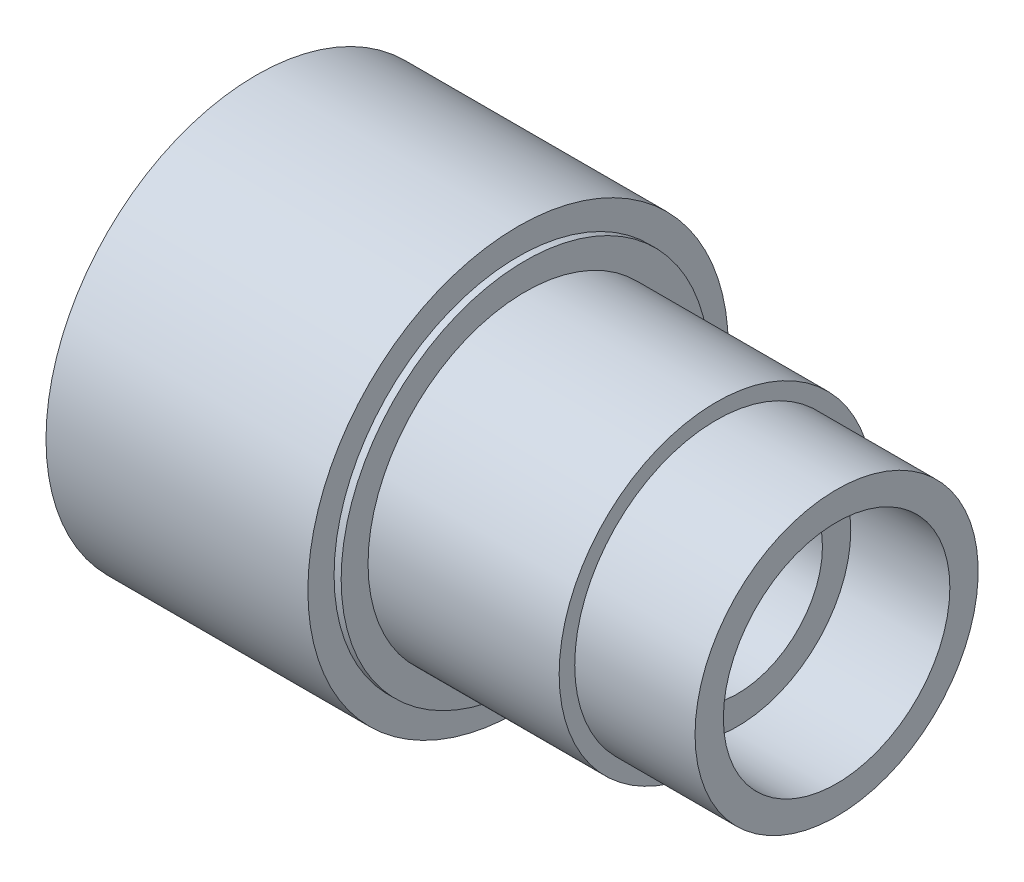
ISO-10303-21;
HEADER;
FILE_DESCRIPTION(('STEP AP214'),'2;1');
FILE_NAME('part.step','',(''),(''),'','','');
FILE_SCHEMA(('AUTOMOTIVE_DESIGN { 1 0 10303 214 1 1 1 1 }'));
ENDSEC;
DATA;
#1=APPLICATION_CONTEXT('core data for automotive mechanical design processes');
#2=APPLICATION_PROTOCOL_DEFINITION('international standard','automotive_design',2000,#1);
#3=PRODUCT_CONTEXT('',#1,'mechanical');
#4=PRODUCT('Part','Part','',(#3));
#5=PRODUCT_RELATED_PRODUCT_CATEGORY('part','',(#4));
#6=PRODUCT_DEFINITION_FORMATION('','',#4);
#7=PRODUCT_DEFINITION_CONTEXT('part definition',#1,'design');
#8=PRODUCT_DEFINITION('design','',#6,#7);
#9=PRODUCT_DEFINITION_SHAPE('','',#8);
#10=(LENGTH_UNIT() NAMED_UNIT(*) SI_UNIT(.MILLI.,.METRE.));
#11=(NAMED_UNIT(*) PLANE_ANGLE_UNIT() SI_UNIT($,.RADIAN.));
#12=(NAMED_UNIT(*) SI_UNIT($,.STERADIAN.) SOLID_ANGLE_UNIT());
#13=UNCERTAINTY_MEASURE_WITH_UNIT(LENGTH_MEASURE(1.E-05),#10,'distance_accuracy_value','');
#14=(GEOMETRIC_REPRESENTATION_CONTEXT(3) GLOBAL_UNCERTAINTY_ASSIGNED_CONTEXT((#13)) GLOBAL_UNIT_ASSIGNED_CONTEXT((#10,
#11,#12)) REPRESENTATION_CONTEXT('',''));
#15=CARTESIAN_POINT('',(0.,0.,0.));
#16=DIRECTION('',(0.,0.,1.));
#17=DIRECTION('',(1.,0.,0.));
#18=AXIS2_PLACEMENT_3D('',#15,#16,#17);
#19=CARTESIAN_POINT('',(15.,8.,0.));
#20=DIRECTION('',(-1.,0.,0.));
#21=DIRECTION('',(0.,0.,1.));
#22=AXIS2_PLACEMENT_3D('',#19,#20,#21);
#23=PLANE('',#22);
#24=CARTESIAN_POINT('',(15.,0.,0.));
#25=DIRECTION('',(1.,0.,0.));
#26=DIRECTION('',(0.,0.,-1.));
#27=AXIS2_PLACEMENT_3D('',#24,#25,#26);
#28=CIRCLE('',#27,6.);
#29=CARTESIAN_POINT('',(15.,0.,-6.));
#30=VERTEX_POINT('',#29);
#31=EDGE_CURVE('E80',#30,#30,#28,.T.);
#32=ORIENTED_EDGE('',*,*,#31,.F.);
#33=EDGE_LOOP('',(#32));
#34=FACE_BOUND('',#33,.T.);
#35=CARTESIAN_POINT('',(15.,0.,0.));
#36=DIRECTION('',(-1.,0.,0.));
#37=DIRECTION('',(0.,0.,1.));
#38=AXIS2_PLACEMENT_3D('',#35,#36,#37);
#39=CIRCLE('',#38,8.);
#40=CARTESIAN_POINT('',(15.,0.,8.));
#41=VERTEX_POINT('',#40);
#42=EDGE_CURVE('E44',#41,#41,#39,.T.);
#43=ORIENTED_EDGE('',*,*,#42,.F.);
#44=EDGE_LOOP('',(#43));
#45=FACE_BOUND('',#44,.T.);
#46=ADVANCED_FACE('F15',(#34,#45),#23,.F.);
#47=CARTESIAN_POINT('',(-84.7960698689956,0.,0.));
#48=DIRECTION('',(-1.,0.,0.));
#49=DIRECTION('',(0.,0.,1.));
#50=AXIS2_PLACEMENT_3D('',#47,#48,#49);
#51=CYLINDRICAL_SURFACE('',#50,8.);
#52=CARTESIAN_POINT('',(22.,0.,0.));
#53=DIRECTION('',(-1.,0.,0.));
#54=DIRECTION('',(0.,0.,1.));
#55=AXIS2_PLACEMENT_3D('',#52,#53,#54);
#56=CIRCLE('',#55,8.);
#57=CARTESIAN_POINT('',(22.,0.,8.));
#58=VERTEX_POINT('',#57);
#59=EDGE_CURVE('E47',#58,#58,#56,.T.);
#60=ORIENTED_EDGE('',*,*,#59,.F.);
#61=EDGE_LOOP('',(#60));
#62=FACE_BOUND('',#61,.T.);
#63=ORIENTED_EDGE('',*,*,#42,.T.);
#64=EDGE_LOOP('',(#63));
#65=FACE_BOUND('',#64,.T.);
#66=ADVANCED_FACE('F88',(#62,#65),#51,.F.);
#67=CARTESIAN_POINT('',(22.,10.,0.));
#68=DIRECTION('',(-1.,0.,0.));
#69=DIRECTION('',(0.,0.,1.));
#70=AXIS2_PLACEMENT_3D('',#67,#68,#69);
#71=PLANE('',#70);
#72=CARTESIAN_POINT('',(22.,0.,0.));
#73=DIRECTION('',(-1.,0.,0.));
#74=DIRECTION('',(0.,0.,1.));
#75=AXIS2_PLACEMENT_3D('',#72,#73,#74);
#76=CIRCLE('',#75,10.);
#77=CARTESIAN_POINT('',(22.,0.,10.));
#78=VERTEX_POINT('',#77);
#79=EDGE_CURVE('E50',#78,#78,#76,.T.);
#80=ORIENTED_EDGE('',*,*,#79,.F.);
#81=EDGE_LOOP('',(#80));
#82=FACE_BOUND('',#81,.T.);
#83=ORIENTED_EDGE('',*,*,#59,.T.);
#84=EDGE_LOOP('',(#83));
#85=FACE_BOUND('',#84,.T.);
#86=ADVANCED_FACE('F93',(#82,#85),#71,.F.);
#87=CARTESIAN_POINT('',(-84.7960698689956,0.,0.));
#88=DIRECTION('',(-1.,0.,0.));
#89=DIRECTION('',(0.,0.,1.));
#90=AXIS2_PLACEMENT_3D('',#87,#88,#89);
#91=CYLINDRICAL_SURFACE('',#90,10.);
#92=CARTESIAN_POINT('',(13.5,0.,0.));
#93=DIRECTION('',(-1.,0.,0.));
#94=DIRECTION('',(0.,0.,1.));
#95=AXIS2_PLACEMENT_3D('',#92,#93,#94);
#96=CIRCLE('',#95,10.);
#97=CARTESIAN_POINT('',(13.5,0.,10.));
#98=VERTEX_POINT('',#97);
#99=EDGE_CURVE('E53',#98,#98,#96,.T.);
#100=ORIENTED_EDGE('',*,*,#99,.F.);
#101=EDGE_LOOP('',(#100));
#102=FACE_BOUND('',#101,.T.);
#103=ORIENTED_EDGE('',*,*,#79,.T.);
#104=EDGE_LOOP('',(#103));
#105=FACE_BOUND('',#104,.T.);
#106=ADVANCED_FACE('F100',(#102,#105),#91,.T.);
#107=CARTESIAN_POINT('',(13.5,11.1,0.));
#108=DIRECTION('',(-1.,0.,0.));
#109=DIRECTION('',(0.,0.,1.));
#110=AXIS2_PLACEMENT_3D('',#107,#108,#109);
#111=PLANE('',#110);
#112=CARTESIAN_POINT('',(13.5,0.,0.));
#113=DIRECTION('',(-1.,0.,0.));
#114=DIRECTION('',(0.,0.,1.));
#115=AXIS2_PLACEMENT_3D('',#112,#113,#114);
#116=CIRCLE('',#115,11.1);
#117=CARTESIAN_POINT('',(13.5,0.,11.1));
#118=VERTEX_POINT('',#117);
#119=EDGE_CURVE('E56',#118,#118,#116,.T.);
#120=ORIENTED_EDGE('',*,*,#119,.F.);
#121=EDGE_LOOP('',(#120));
#122=FACE_BOUND('',#121,.T.);
#123=ORIENTED_EDGE('',*,*,#99,.T.);
#124=EDGE_LOOP('',(#123));
#125=FACE_BOUND('',#124,.T.);
#126=ADVANCED_FACE('F175',(#122,#125),#111,.F.);
#127=CARTESIAN_POINT('',(-84.7960698689956,0.,0.));
#128=DIRECTION('',(-1.,0.,0.));
#129=DIRECTION('',(0.,0.,1.));
#130=AXIS2_PLACEMENT_3D('',#127,#128,#129);
#131=CYLINDRICAL_SURFACE('',#130,11.1);
#132=CARTESIAN_POINT('',(0.,0.,0.));
#133=DIRECTION('',(-1.,0.,0.));
#134=DIRECTION('',(0.,0.,1.));
#135=AXIS2_PLACEMENT_3D('',#132,#133,#134);
#136=CIRCLE('',#135,11.1);
#137=CARTESIAN_POINT('',(0.,0.,11.1));
#138=VERTEX_POINT('',#137);
#139=EDGE_CURVE('E59',#138,#138,#136,.T.);
#140=ORIENTED_EDGE('',*,*,#139,.F.);
#141=EDGE_LOOP('',(#140));
#142=FACE_BOUND('',#141,.T.);
#143=ORIENTED_EDGE('',*,*,#119,.T.);
#144=EDGE_LOOP('',(#143));
#145=FACE_BOUND('',#144,.T.);
#146=ADVANCED_FACE('F171',(#142,#145),#131,.T.);
#147=CARTESIAN_POINT('',(0.,13.,0.));
#148=DIRECTION('',(-1.,0.,0.));
#149=DIRECTION('',(0.,0.,1.));
#150=AXIS2_PLACEMENT_3D('',#147,#148,#149);
#151=PLANE('',#150);
#152=CARTESIAN_POINT('',(0.,0.,0.));
#153=DIRECTION('',(-1.,0.,0.));
#154=DIRECTION('',(0.,0.,1.));
#155=AXIS2_PLACEMENT_3D('',#152,#153,#154);
#156=CIRCLE('',#155,13.);
#157=CARTESIAN_POINT('',(0.,0.,13.));
#158=VERTEX_POINT('',#157);
#159=EDGE_CURVE('E62',#158,#158,#156,.T.);
#160=ORIENTED_EDGE('',*,*,#159,.F.);
#161=EDGE_LOOP('',(#160));
#162=FACE_BOUND('',#161,.T.);
#163=ORIENTED_EDGE('',*,*,#139,.T.);
#164=EDGE_LOOP('',(#163));
#165=FACE_BOUND('',#164,.T.);
#166=ADVANCED_FACE('F167',(#162,#165),#151,.F.);
#167=CARTESIAN_POINT('',(-84.7960698689956,0.,0.));
#168=DIRECTION('',(-1.,0.,0.));
#169=DIRECTION('',(0.,0.,1.));
#170=AXIS2_PLACEMENT_3D('',#167,#168,#169);
#171=CYLINDRICAL_SURFACE('',#170,13.);
#172=CARTESIAN_POINT('',(-0.5,0.,0.));
#173=DIRECTION('',(-1.,0.,0.));
#174=DIRECTION('',(0.,0.,1.));
#175=AXIS2_PLACEMENT_3D('',#172,#173,#174);
#176=CIRCLE('',#175,13.);
#177=CARTESIAN_POINT('',(-0.5,0.,13.));
#178=VERTEX_POINT('',#177);
#179=EDGE_CURVE('E65',#178,#178,#176,.T.);
#180=ORIENTED_EDGE('',*,*,#179,.F.);
#181=EDGE_LOOP('',(#180));
#182=FACE_BOUND('',#181,.T.);
#183=ORIENTED_EDGE('',*,*,#159,.T.);
#184=EDGE_LOOP('',(#183));
#185=FACE_BOUND('',#184,.T.);
#186=ADVANCED_FACE('F163',(#182,#185),#171,.T.);
#187=CARTESIAN_POINT('',(-0.5,13.5,0.));
#188=DIRECTION('',(-1.,0.,0.));
#189=DIRECTION('',(0.,0.,1.));
#190=AXIS2_PLACEMENT_3D('',#187,#188,#189);
#191=PLANE('',#190);
#192=ORIENTED_EDGE('',*,*,#179,.T.);
#193=EDGE_LOOP('',(#192));
#194=FACE_BOUND('',#193,.T.);
#195=CARTESIAN_POINT('',(-0.5,0.,0.));
#196=DIRECTION('',(1.,0.,0.));
#197=DIRECTION('',(0.,0.,-1.));
#198=AXIS2_PLACEMENT_3D('',#195,#196,#197);
#199=CIRCLE('',#198,14.85);
#200=CARTESIAN_POINT('',(-0.5,0.,-14.85));
#201=VERTEX_POINT('',#200);
#202=EDGE_CURVE('E71',#201,#201,#199,.T.);
#203=ORIENTED_EDGE('',*,*,#202,.T.);
#204=EDGE_LOOP('',(#203));
#205=FACE_BOUND('',#204,.T.);
#206=ADVANCED_FACE('F153',(#194,#205),#191,.F.);
#207=CARTESIAN_POINT('',(-19.,0.,0.));
#208=DIRECTION('',(1.,0.,0.));
#209=DIRECTION('',(0.,0.,-1.));
#210=AXIS2_PLACEMENT_3D('',#207,#208,#209);
#211=CYLINDRICAL_SURFACE('',#210,12.);
#212=CARTESIAN_POINT('',(-19.,0.,0.));
#213=DIRECTION('',(1.,0.,0.));
#214=DIRECTION('',(0.,0.,-1.));
#215=AXIS2_PLACEMENT_3D('',#212,#213,#214);
#216=CIRCLE('',#215,12.);
#217=CARTESIAN_POINT('',(-19.,0.,-12.));
#218=VERTEX_POINT('',#217);
#219=EDGE_CURVE('E74',#218,#218,#216,.T.);
#220=ORIENTED_EDGE('',*,*,#219,.F.);
#221=EDGE_LOOP('',(#220));
#222=FACE_BOUND('',#221,.T.);
#223=CARTESIAN_POINT('',(-5.5,0.,0.));
#224=DIRECTION('',(1.,0.,0.));
#225=DIRECTION('',(0.,0.,-1.));
#226=AXIS2_PLACEMENT_3D('',#223,#224,#225);
#227=CIRCLE('',#226,12.);
#228=CARTESIAN_POINT('',(-5.5,0.,-12.));
#229=VERTEX_POINT('',#228);
#230=EDGE_CURVE('E10',#229,#229,#227,.T.);
#231=ORIENTED_EDGE('',*,*,#230,.T.);
#232=EDGE_LOOP('',(#231));
#233=FACE_BOUND('',#232,.T.);
#234=ADVANCED_FACE('F149',(#222,#233),#211,.F.);
#235=CARTESIAN_POINT('',(-19.,0.,0.));
#236=DIRECTION('',(1.,0.,0.));
#237=DIRECTION('',(0.,0.,-1.));
#238=AXIS2_PLACEMENT_3D('',#235,#236,#237);
#239=CYLINDRICAL_SURFACE('',#238,14.85);
#240=CARTESIAN_POINT('',(-19.,0.,0.));
#241=DIRECTION('',(1.,0.,0.));
#242=DIRECTION('',(0.,0.,-1.));
#243=AXIS2_PLACEMENT_3D('',#240,#241,#242);
#244=CIRCLE('',#243,14.85);
#245=CARTESIAN_POINT('',(-19.,0.,-14.85));
#246=VERTEX_POINT('',#245);
#247=EDGE_CURVE('E68',#246,#246,#244,.T.);
#248=ORIENTED_EDGE('',*,*,#247,.T.);
#249=EDGE_LOOP('',(#248));
#250=FACE_BOUND('',#249,.T.);
#251=ORIENTED_EDGE('',*,*,#202,.F.);
#252=EDGE_LOOP('',(#251));
#253=FACE_BOUND('',#252,.T.);
#254=ADVANCED_FACE('F152',(#250,#253),#239,.T.);
#255=CARTESIAN_POINT('',(-19.,0.,0.));
#256=DIRECTION('',(1.,0.,0.));
#257=DIRECTION('',(0.,0.,-1.));
#258=AXIS2_PLACEMENT_3D('',#255,#256,#257);
#259=PLANE('',#258);
#260=ORIENTED_EDGE('',*,*,#219,.T.);
#261=EDGE_LOOP('',(#260));
#262=FACE_BOUND('',#261,.T.);
#263=ORIENTED_EDGE('',*,*,#247,.F.);
#264=EDGE_LOOP('',(#263));
#265=FACE_BOUND('',#264,.T.);
#266=ADVANCED_FACE('F110',(#262,#265),#259,.F.);
#267=CARTESIAN_POINT('',(-13.8,8.95,0.));
#268=DIRECTION('',(1.,0.,0.));
#269=DIRECTION('',(0.,0.,-1.));
#270=AXIS2_PLACEMENT_3D('',#267,#268,#269);
#271=PLANE('',#270);
#272=CARTESIAN_POINT('',(-13.8,0.,0.));
#273=DIRECTION('',(-1.,0.,0.));
#274=DIRECTION('',(0.,0.,1.));
#275=AXIS2_PLACEMENT_3D('',#272,#273,#274);
#276=CIRCLE('',#275,8.95);
#277=CARTESIAN_POINT('',(-13.8,0.,8.95));
#278=VERTEX_POINT('',#277);
#279=EDGE_CURVE('E41',#278,#278,#276,.T.);
#280=ORIENTED_EDGE('',*,*,#279,.T.);
#281=EDGE_LOOP('',(#280));
#282=FACE_BOUND('',#281,.T.);
#283=ADVANCED_FACE('F106',(#282),#271,.F.);
#284=CARTESIAN_POINT('',(-84.7960698689956,0.,0.));
#285=DIRECTION('',(-1.,0.,0.));
#286=DIRECTION('',(0.,0.,1.));
#287=AXIS2_PLACEMENT_3D('',#284,#285,#286);
#288=CYLINDRICAL_SURFACE('',#287,8.95);
#289=ORIENTED_EDGE('',*,*,#279,.F.);
#290=EDGE_LOOP('',(#289));
#291=FACE_BOUND('',#290,.T.);
#292=CARTESIAN_POINT('',(-11.8,0.,0.));
#293=DIRECTION('',(-1.,0.,0.));
#294=DIRECTION('',(0.,0.,1.));
#295=AXIS2_PLACEMENT_3D('',#292,#293,#294);
#296=CIRCLE('',#295,8.95);
#297=CARTESIAN_POINT('',(-11.8,0.,8.95));
#298=VERTEX_POINT('',#297);
#299=EDGE_CURVE('E38',#298,#298,#296,.T.);
#300=ORIENTED_EDGE('',*,*,#299,.T.);
#301=EDGE_LOOP('',(#300));
#302=FACE_BOUND('',#301,.T.);
#303=ADVANCED_FACE('F109',(#291,#302),#288,.T.);
#304=CARTESIAN_POINT('',(-11.8,11.,0.));
#305=DIRECTION('',(1.,0.,0.));
#306=DIRECTION('',(0.,0.,-1.));
#307=AXIS2_PLACEMENT_3D('',#304,#305,#306);
#308=PLANE('',#307);
#309=ORIENTED_EDGE('',*,*,#299,.F.);
#310=EDGE_LOOP('',(#309));
#311=FACE_BOUND('',#310,.T.);
#312=CARTESIAN_POINT('',(-11.8,0.,0.));
#313=DIRECTION('',(-1.,0.,0.));
#314=DIRECTION('',(0.,0.,1.));
#315=AXIS2_PLACEMENT_3D('',#312,#313,#314);
#316=CIRCLE('',#315,11.);
#317=CARTESIAN_POINT('',(-11.8,0.,11.));
#318=VERTEX_POINT('',#317);
#319=EDGE_CURVE('E35',#318,#318,#316,.T.);
#320=ORIENTED_EDGE('',*,*,#319,.T.);
#321=EDGE_LOOP('',(#320));
#322=FACE_BOUND('',#321,.T.);
#323=ADVANCED_FACE('F114',(#311,#322),#308,.F.);
#324=CARTESIAN_POINT('',(-84.7960698689956,0.,0.));
#325=DIRECTION('',(-1.,0.,0.));
#326=DIRECTION('',(0.,0.,1.));
#327=AXIS2_PLACEMENT_3D('',#324,#325,#326);
#328=CYLINDRICAL_SURFACE('',#327,11.);
#329=ORIENTED_EDGE('',*,*,#319,.F.);
#330=EDGE_LOOP('',(#329));
#331=FACE_BOUND('',#330,.T.);
#332=CARTESIAN_POINT('',(-8.8,0.,0.));
#333=DIRECTION('',(-1.,0.,0.));
#334=DIRECTION('',(0.,0.,1.));
#335=AXIS2_PLACEMENT_3D('',#332,#333,#334);
#336=CIRCLE('',#335,11.);
#337=CARTESIAN_POINT('',(-8.8,0.,11.));
#338=VERTEX_POINT('',#337);
#339=EDGE_CURVE('E30',#338,#338,#336,.T.);
#340=ORIENTED_EDGE('',*,*,#339,.T.);
#341=EDGE_LOOP('',(#340));
#342=FACE_BOUND('',#341,.T.);
#343=ADVANCED_FACE('F118',(#331,#342),#328,.T.);
#344=CARTESIAN_POINT('',(-8.8,8.,0.));
#345=DIRECTION('',(-1.,0.,0.));
#346=DIRECTION('',(0.,0.,1.));
#347=AXIS2_PLACEMENT_3D('',#344,#345,#346);
#348=PLANE('',#347);
#349=ORIENTED_EDGE('',*,*,#339,.F.);
#350=EDGE_LOOP('',(#349));
#351=FACE_BOUND('',#350,.T.);
#352=CARTESIAN_POINT('',(-8.8,0.,0.));
#353=DIRECTION('',(-1.,0.,0.));
#354=DIRECTION('',(0.,0.,1.));
#355=AXIS2_PLACEMENT_3D('',#352,#353,#354);
#356=CIRCLE('',#355,8.);
#357=CARTESIAN_POINT('',(-8.8,0.,8.));
#358=VERTEX_POINT('',#357);
#359=EDGE_CURVE('E26',#358,#358,#356,.T.);
#360=ORIENTED_EDGE('',*,*,#359,.T.);
#361=EDGE_LOOP('',(#360));
#362=FACE_BOUND('',#361,.T.);
#363=ADVANCED_FACE('F122',(#351,#362),#348,.F.);
#364=CARTESIAN_POINT('',(-84.7960698689956,0.,0.));
#365=DIRECTION('',(-1.,0.,0.));
#366=DIRECTION('',(0.,0.,1.));
#367=AXIS2_PLACEMENT_3D('',#364,#365,#366);
#368=CYLINDRICAL_SURFACE('',#367,8.);
#369=ORIENTED_EDGE('',*,*,#359,.F.);
#370=EDGE_LOOP('',(#369));
#371=FACE_BOUND('',#370,.T.);
#372=CARTESIAN_POINT('',(-5.5,0.,0.));
#373=DIRECTION('',(-1.,0.,0.));
#374=DIRECTION('',(0.,0.,1.));
#375=AXIS2_PLACEMENT_3D('',#372,#373,#374);
#376=CIRCLE('',#375,8.);
#377=CARTESIAN_POINT('',(-5.5,0.,8.));
#378=VERTEX_POINT('',#377);
#379=EDGE_CURVE('E22',#378,#378,#376,.T.);
#380=ORIENTED_EDGE('',*,*,#379,.T.);
#381=EDGE_LOOP('',(#380));
#382=FACE_BOUND('',#381,.T.);
#383=ADVANCED_FACE('F125',(#371,#382),#368,.T.);
#384=CARTESIAN_POINT('',(-5.5,13.5,0.));
#385=DIRECTION('',(1.,0.,0.));
#386=DIRECTION('',(0.,0.,-1.));
#387=AXIS2_PLACEMENT_3D('',#384,#385,#386);
#388=PLANE('',#387);
#389=ORIENTED_EDGE('',*,*,#379,.F.);
#390=EDGE_LOOP('',(#389));
#391=FACE_BOUND('',#390,.T.);
#392=ORIENTED_EDGE('',*,*,#230,.F.);
#393=EDGE_LOOP('',(#392));
#394=FACE_BOUND('',#393,.T.);
#395=ADVANCED_FACE('F17',(#391,#394),#388,.F.);
#396=CARTESIAN_POINT('',(2.,0.,0.));
#397=DIRECTION('',(1.,0.,0.));
#398=DIRECTION('',(0.,0.,-1.));
#399=AXIS2_PLACEMENT_3D('',#396,#397,#398);
#400=CYLINDRICAL_SURFACE('',#399,6.);
#401=CARTESIAN_POINT('',(2.,0.,0.));
#402=DIRECTION('',(1.,0.,0.));
#403=DIRECTION('',(0.,0.,-1.));
#404=AXIS2_PLACEMENT_3D('',#401,#402,#403);
#405=CIRCLE('',#404,6.);
#406=CARTESIAN_POINT('',(2.,0.,-6.));
#407=VERTEX_POINT('',#406);
#408=EDGE_CURVE('E77',#407,#407,#405,.T.);
#409=ORIENTED_EDGE('',*,*,#408,.F.);
#410=EDGE_LOOP('',(#409));
#411=FACE_BOUND('',#410,.T.);
#412=ORIENTED_EDGE('',*,*,#31,.T.);
#413=EDGE_LOOP('',(#412));
#414=FACE_BOUND('',#413,.T.);
#415=ADVANCED_FACE('F84',(#411,#414),#400,.F.);
#416=CARTESIAN_POINT('',(2.,0.,0.));
#417=DIRECTION('',(1.,0.,0.));
#418=DIRECTION('',(0.,0.,-1.));
#419=AXIS2_PLACEMENT_3D('',#416,#417,#418);
#420=PLANE('',#419);
#421=ORIENTED_EDGE('',*,*,#408,.T.);
#422=EDGE_LOOP('',(#421));
#423=FACE_BOUND('',#422,.T.);
#424=ADVANCED_FACE('F138',(#423),#420,.T.);
#425=CLOSED_SHELL('',(#46,#66,#86,#106,#126,#146,#166,#186,#206,#234,#254,#266,#283,#303,#323,
#343,#363,#383,#395,#415,#424));
#426=MANIFOLD_SOLID_BREP('B1',#425);
#427=ADVANCED_BREP_SHAPE_REPRESENTATION('',(#18,#426),#14);
#428=SHAPE_DEFINITION_REPRESENTATION(#9,#427);
ENDSEC;
END-ISO-10303-21;
